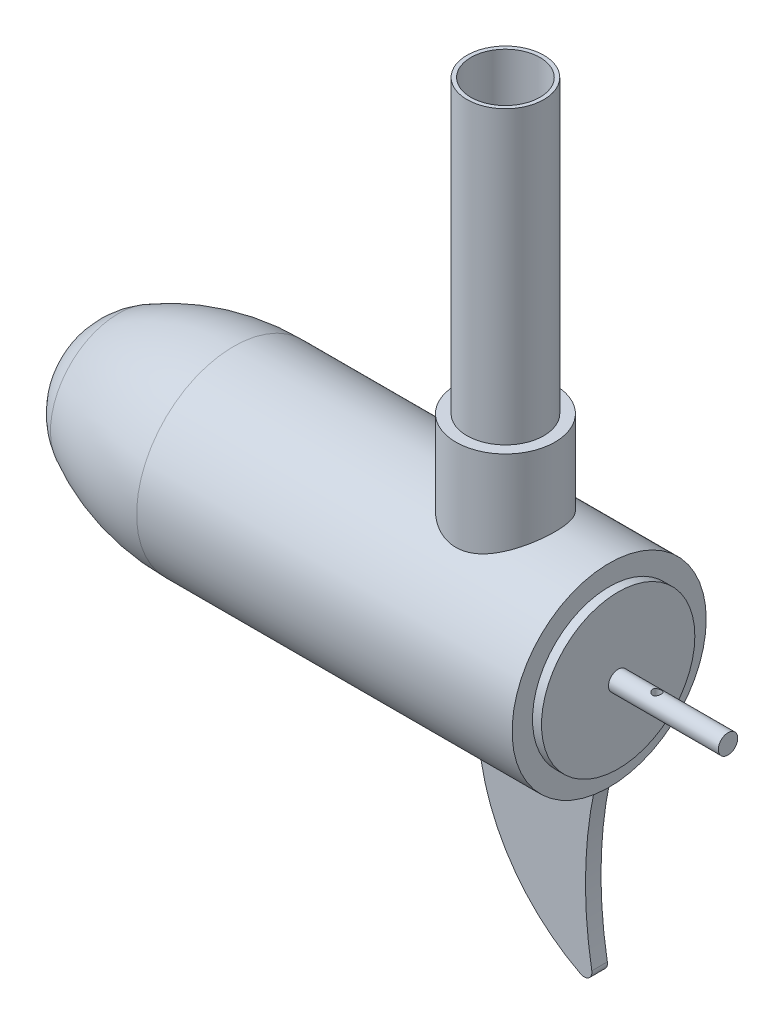
ISO-10303-21;
HEADER;
FILE_DESCRIPTION(('STEP AP214'),'2;1');
FILE_NAME('part.step','',(''),(''),'','','');
FILE_SCHEMA(('AUTOMOTIVE_DESIGN { 1 0 10303 214 1 1 1 1 }'));
ENDSEC;
DATA;
#1=APPLICATION_CONTEXT('core data for automotive mechanical design processes');
#2=APPLICATION_PROTOCOL_DEFINITION('international standard','automotive_design',2000,#1);
#3=PRODUCT_CONTEXT('',#1,'mechanical');
#4=PRODUCT('Part','Part','',(#3));
#5=PRODUCT_RELATED_PRODUCT_CATEGORY('part','',(#4));
#6=PRODUCT_DEFINITION_FORMATION('','',#4);
#7=PRODUCT_DEFINITION_CONTEXT('part definition',#1,'design');
#8=PRODUCT_DEFINITION('design','',#6,#7);
#9=PRODUCT_DEFINITION_SHAPE('','',#8);
#10=(LENGTH_UNIT() NAMED_UNIT(*) SI_UNIT(.MILLI.,.METRE.));
#11=(NAMED_UNIT(*) PLANE_ANGLE_UNIT() SI_UNIT($,.RADIAN.));
#12=(NAMED_UNIT(*) SI_UNIT($,.STERADIAN.) SOLID_ANGLE_UNIT());
#13=UNCERTAINTY_MEASURE_WITH_UNIT(LENGTH_MEASURE(1.E-05),#10,'distance_accuracy_value','');
#14=(GEOMETRIC_REPRESENTATION_CONTEXT(3) GLOBAL_UNCERTAINTY_ASSIGNED_CONTEXT((#13)) GLOBAL_UNIT_ASSIGNED_CONTEXT((#10,
#11,#12)) REPRESENTATION_CONTEXT('',''));
#15=CARTESIAN_POINT('',(0.,0.,0.));
#16=DIRECTION('',(0.,0.,1.));
#17=DIRECTION('',(1.,0.,0.));
#18=AXIS2_PLACEMENT_3D('',#15,#16,#17);
#19=CARTESIAN_POINT('',(0.,635.,0.));
#20=DIRECTION('',(0.,-1.,0.));
#21=DIRECTION('',(0.,0.,-1.));
#22=AXIS2_PLACEMENT_3D('',#19,#20,#21);
#23=CYLINDRICAL_SURFACE('',#22,12.573);
#24=CARTESIAN_POINT('',(0.,57.15,0.));
#25=DIRECTION('',(0.,1.,0.));
#26=DIRECTION('',(0.,0.,1.));
#27=AXIS2_PLACEMENT_3D('',#24,#25,#26);
#28=CIRCLE('',#27,12.573);
#29=CARTESIAN_POINT('',(0.,57.15,12.573));
#30=VERTEX_POINT('',#29);
#31=EDGE_CURVE('E115',#30,#30,#28,.T.);
#32=ORIENTED_EDGE('',*,*,#31,.T.);
#33=EDGE_LOOP('',(#32));
#34=FACE_BOUND('',#33,.T.);
#35=CARTESIAN_POINT('',(0.,152.4,0.));
#36=DIRECTION('',(0.,1.,0.));
#37=DIRECTION('',(0.,0.,1.));
#38=AXIS2_PLACEMENT_3D('',#35,#36,#37);
#39=CIRCLE('',#38,12.573);
#40=CARTESIAN_POINT('',(0.,152.4,12.573));
#41=VERTEX_POINT('',#40);
#42=EDGE_CURVE('E247',#41,#41,#39,.T.);
#43=ORIENTED_EDGE('',*,*,#42,.F.);
#44=EDGE_LOOP('',(#43));
#45=FACE_BOUND('',#44,.T.);
#46=ADVANCED_FACE('F36',(#34,#45),#23,.T.);
#47=CARTESIAN_POINT('',(0.,0.,0.));
#48=DIRECTION('',(1.,0.,0.));
#49=DIRECTION('',(0.,0.,-1.));
#50=AXIS2_PLACEMENT_3D('',#47,#48,#49);
#51=CYLINDRICAL_SURFACE('',#50,31.75);
#52=CARTESIAN_POINT('',(0.,27.3105372292454,-16.1925));
#53=CARTESIAN_POINT('',(-0.420748466015102,27.3105387069206,-16.1924989710694));
#54=CARTESIAN_POINT('',(-0.84151769713939,27.3202933337456,-16.1760793734818));
#55=CARTESIAN_POINT('',(-1.67978725725636,27.3589417899797,-16.1106244902705));
#56=CARTESIAN_POINT('',(-2.09728606689724,27.3878440365096,-16.0615748607399));
#57=CARTESIAN_POINT('',(-2.92632111293447,27.4637594355387,-15.9314180671734));
#58=CARTESIAN_POINT('',(-3.33784558043734,27.5108043289193,-15.8502547131046));
#59=CARTESIAN_POINT('',(-4.15122337999637,27.6212909415034,-15.6569202015565));
#60=CARTESIAN_POINT('',(-4.55307755733656,27.6847312218468,-15.544751765025));
#61=CARTESIAN_POINT('',(-5.3424663710121,27.8254800962585,-15.2913705658272));
#62=CARTESIAN_POINT('',(-5.73006792150555,27.9027100346481,-15.1503218980556));
#63=CARTESIAN_POINT('',(-6.49123738513855,28.0689084733055,-14.8401419463507));
#64=CARTESIAN_POINT('',(-6.86480503600685,28.1578771928123,-14.6710101379081));
#65=CARTESIAN_POINT('',(-7.59612644232784,28.3450458663397,-14.3060443325047));
#66=CARTESIAN_POINT('',(-7.95388335488376,28.4432439650725,-14.1102156985839));
#67=CARTESIAN_POINT('',(-8.65234384595785,28.6464097106673,-13.6930474766081));
#68=CARTESIAN_POINT('',(-8.99304108812239,28.7513798401731,-13.4716985090568));
#69=CARTESIAN_POINT('',(-9.6844468708347,28.9747806383787,-12.9846973009489));
#70=CARTESIAN_POINT('',(-10.0335036881233,29.0935932243362,-12.7168729923331));
#71=CARTESIAN_POINT('',(-10.7083163650837,29.3331547094797,-12.1540965481257));
#72=CARTESIAN_POINT('',(-11.0340709743125,29.4539037121527,-11.8591429586611));
#73=CARTESIAN_POINT('',(-11.6609534581884,29.6944344654934,-11.2433264131629));
#74=CARTESIAN_POINT('',(-11.9620647596046,29.8142155171817,-10.9224463044879));
#75=CARTESIAN_POINT('',(-12.5377223547456,30.0498082670856,-10.2565210067565));
#76=CARTESIAN_POINT('',(-12.8122774992704,30.1656212794259,-9.91148393543222));
#77=CARTESIAN_POINT('',(-13.3518173606166,30.3985707195755,-9.17330970553672));
#78=CARTESIAN_POINT('',(-13.6147292882266,30.5152144127099,-8.77849695562083));
#79=CARTESIAN_POINT('',(-14.1060859296451,30.7375844730744,-7.96499815906814));
#80=CARTESIAN_POINT('',(-14.3345285661519,30.8433101822081,-7.54631067570729));
#81=CARTESIAN_POINT('',(-14.7545606871617,31.040749870666,-6.68791257607114));
#82=CARTESIAN_POINT('',(-14.9461687204122,31.1324708974947,-6.24821268100757));
#83=CARTESIAN_POINT('',(-15.2904317013661,31.2992019943351,-5.35076227152712));
#84=CARTESIAN_POINT('',(-15.4430909828293,31.374213923421,-4.89301377189654));
#85=CARTESIAN_POINT('',(-15.6977262022939,31.5003611897658,-3.99737367876167));
#86=CARTESIAN_POINT('',(-15.8026030690177,31.5528464083167,-3.56049615747574));
#87=CARTESIAN_POINT('',(-15.9758775656995,31.6399823498011,-2.67780437655771));
#88=CARTESIAN_POINT('',(-16.0442768344999,31.6746338739531,-2.23199051934551));
#89=CARTESIAN_POINT('',(-16.1436407309051,31.7250807335097,-1.33538777339915));
#90=CARTESIAN_POINT('',(-16.1746253070345,31.7408861171217,-0.884601665238475));
#91=CARTESIAN_POINT('',(-16.1987840371121,31.7532034311602,0.0182342829470127));
#92=CARTESIAN_POINT('',(-16.1919606286812,31.7497166054271,0.470284039621484));
#93=CARTESIAN_POINT('',(-16.1429411815475,31.7247478570976,1.33082900945518));
#94=CARTESIAN_POINT('',(-16.1040027594924,31.7049233073107,1.73956297698246));
#95=CARTESIAN_POINT('',(-15.9954051492326,31.6499010006413,2.55185134842287));
#96=CARTESIAN_POINT('',(-15.9257482141708,31.6147043712728,2.95540612998548));
#97=CARTESIAN_POINT('',(-15.7564827199828,31.5297770344751,3.75462129565882));
#98=CARTESIAN_POINT('',(-15.6568731777315,31.4800458499842,4.15028142019104));
#99=CARTESIAN_POINT('',(-15.4287297961663,31.3672014027916,4.93121144994875));
#100=CARTESIAN_POINT('',(-15.3001948993253,31.3040876508206,5.31648097471123));
#101=CARTESIAN_POINT('',(-15.0135188568846,31.1649688015372,6.07943989650621));
#102=CARTESIAN_POINT('',(-14.8550070053428,31.0888035508072,6.45696054572714));
#103=CARTESIAN_POINT('',(-14.5108989011623,30.925857656925,7.19704235782948));
#104=CARTESIAN_POINT('',(-14.3253026980021,30.8390770331652,7.55960354803776));
#105=CARTESIAN_POINT('',(-13.9283827222025,30.6567156266017,8.26814061210105));
#106=CARTESIAN_POINT('',(-13.7170529644526,30.5611327978458,8.61411260146137));
#107=CARTESIAN_POINT('',(-13.2700731560107,30.363137827612,9.28793333646348));
#108=CARTESIAN_POINT('',(-13.0344208252362,30.2607250461895,9.61578037857775));
#109=CARTESIAN_POINT('',(-12.5160714758153,30.0409246449944,10.283016158325));
#110=CARTESIAN_POINT('',(-12.2310279904816,29.9230495763589,10.6204237486858));
#111=CARTESIAN_POINT('',(-11.6349275840735,29.6843795787961,11.270313779243));
#112=CARTESIAN_POINT('',(-11.3238691527413,29.5635844806408,11.5827947703034));
#113=CARTESIAN_POINT('',(-10.6771379793242,29.3219493100036,12.1815463782784));
#114=CARTESIAN_POINT('',(-10.3414516860976,29.2011092497176,12.4678023674889));
#115=CARTESIAN_POINT('',(-9.64699772044029,28.962452235663,13.0125845089775));
#116=CARTESIAN_POINT('',(-9.28821914849836,28.844636746733,13.2710974107322));
#117=CARTESIAN_POINT('',(-8.52404517770724,28.6074125207556,13.7753880286337));
#118=CARTESIAN_POINT('',(-8.11713944482276,28.4884441514149,14.0190913551747));
#119=CARTESIAN_POINT('',(-7.28129326799219,28.2616528081136,14.470845378222));
#120=CARTESIAN_POINT('',(-6.85236460258649,28.1538239674553,14.678914879863));
#121=CARTESIAN_POINT('',(-5.97504738907723,27.9532546703778,15.0573546693885));
#122=CARTESIAN_POINT('',(-5.52667019090442,27.8605055597766,15.2277466006037));
#123=CARTESIAN_POINT('',(-4.61338684269047,27.6938149889371,15.5288375462474));
#124=CARTESIAN_POINT('',(-4.1484830497966,27.6198708587606,15.6595421960025));
#125=CARTESIAN_POINT('',(-3.24374665951823,27.4991407403212,15.8705174756291));
#126=CARTESIAN_POINT('',(-2.80488716337229,27.4506542835127,15.9539883583188));
#127=CARTESIAN_POINT('',(-1.91998908200027,27.3743968387433,16.0844849116838));
#128=CARTESIAN_POINT('',(-1.47395091455951,27.3466246496721,16.1315126955068));
#129=CARTESIAN_POINT('',(-0.57897809044468,27.3130157846587,16.1883528298615));
#130=CARTESIAN_POINT('',(-0.130045551038082,27.3071645724646,16.1981898424005));
#131=CARTESIAN_POINT('',(0.766807064801971,27.3176213800444,16.1805494749401));
#132=CARTESIAN_POINT('',(1.21472721395478,27.3339277540833,16.1530748662284));
#133=CARTESIAN_POINT('',(2.05361525851629,27.3848186779578,16.0666217495261));
#134=CARTESIAN_POINT('',(2.44515098536332,27.4170581895218,16.0116765800726));
#135=CARTESIAN_POINT('',(3.22156839319666,27.497179340615,15.8736886599332));
#136=CARTESIAN_POINT('',(3.60645069651641,27.5450595087556,15.7906485522412));
#137=CARTESIAN_POINT('',(4.36733627833684,27.6549681514112,15.5973578563071));
#138=CARTESIAN_POINT('',(4.743337214906,27.7170003127088,15.4871001769103));
#139=CARTESIAN_POINT('',(5.48436670329088,27.8533848077631,15.2404493115307));
#140=CARTESIAN_POINT('',(5.84939456583778,27.9277379135521,15.1040544877067));
#141=CARTESIAN_POINT('',(6.58318079671202,28.0903881460422,14.799450507088));
#142=CARTESIAN_POINT('',(6.95134601777157,28.1791675358805,14.6300714631583));
#143=CARTESIAN_POINT('',(7.67229271056367,28.3656163493504,14.2652121550295));
#144=CARTESIAN_POINT('',(8.02506897498789,28.4632887482051,14.069723145256));
#145=CARTESIAN_POINT('',(8.71381814417392,28.6650940140789,13.6538747999114));
#146=CARTESIAN_POINT('',(9.04978686956206,28.7692284736774,13.4335093224676));
#147=CARTESIAN_POINT('',(9.70360700370493,28.9815425754529,12.9691125783415));
#148=CARTESIAN_POINT('',(10.0214572045398,29.0897224865362,12.7250797367342));
#149=CARTESIAN_POINT('',(10.678730865835,29.3222463054979,12.180607304189));
#150=CARTESIAN_POINT('',(11.0154330119251,29.4468328064333,11.8769780564265));
#151=CARTESIAN_POINT('',(11.6623201282583,29.6948805817402,11.2424453256809));
#152=CARTESIAN_POINT('',(11.9725120584968,29.8183421438018,10.9115490464759));
#153=CARTESIAN_POINT('',(12.5649173333546,30.0610968660521,10.2237953766132));
#154=CARTESIAN_POINT('',(12.8471147863585,30.1803876340094,9.86692343738312));
#155=CARTESIAN_POINT('',(13.3814677820726,30.4116936848314,9.12912039945865));
#156=CARTESIAN_POINT('',(13.6336235434791,30.5237090206567,8.74818947593866));
#157=CARTESIAN_POINT('',(14.1131951757634,30.7408621552026,7.95218391988009));
#158=CARTESIAN_POINT('',(14.3396133998741,30.8456830767824,7.5364199713589));
#159=CARTESIAN_POINT('',(14.7562420682957,31.041557776433,6.68396749079989));
#160=CARTESIAN_POINT('',(14.9464511674889,31.1326110430291,6.24727818216862));
#161=CARTESIAN_POINT('',(15.2883473685012,31.2981891882218,5.35639290256029));
#162=CARTESIAN_POINT('',(15.4400630161999,31.3727263095943,4.90221019389549));
#163=CARTESIAN_POINT('',(15.7031546933985,31.5030383721622,3.97969363986757));
#164=CARTESIAN_POINT('',(15.8145357434036,31.5588156483609,3.51136156356419));
#165=CARTESIAN_POINT('',(15.9868503764071,31.6455344662884,2.60926839584908));
#166=CARTESIAN_POINT('',(16.051543830027,31.6783186778626,2.17639939024798));
#167=CARTESIAN_POINT('',(16.145691733958,31.7261271675578,1.30587673935893));
#168=CARTESIAN_POINT('',(16.1751484674551,31.7411525963697,0.868223405929174));
#169=CARTESIAN_POINT('',(16.1984282269959,31.7530222781351,-0.00813211946787927));
#170=CARTESIAN_POINT('',(16.1922627256626,31.7498723846975,-0.44683392826443));
#171=CARTESIAN_POINT('',(16.1444072969559,31.72549294038,-1.32178045860439));
#172=CARTESIAN_POINT('',(16.1027184819466,31.7042639556222,-1.75802525665517));
#173=CARTESIAN_POINT('',(15.9885463305423,31.6464348177011,-2.59397302273972));
#174=CARTESIAN_POINT('',(15.9184381285208,31.6110223013007,-2.99408604041674));
#175=CARTESIAN_POINT('',(15.7487794704582,31.5259276207634,-3.78644156000793));
#176=CARTESIAN_POINT('',(15.6492307809595,31.4762463128141,-4.17868453264753));
#177=CARTESIAN_POINT('',(15.4216912674134,31.3637407332485,-4.95291051346713));
#178=CARTESIAN_POINT('',(15.2936983699637,31.3009155035434,-5.33489277142983));
#179=CARTESIAN_POINT('',(15.010454358319,31.1635019481535,-6.08642731089245));
#180=CARTESIAN_POINT('',(14.8552019616212,31.0889130690304,-6.4559790065851));
#181=CARTESIAN_POINT('',(14.5117419954506,30.926239389282,-7.19580118419143));
#182=CARTESIAN_POINT('',(14.3224347679716,30.8377231863766,-7.56546592766107));
#183=CARTESIAN_POINT('',(13.9171373353812,30.6515865152353,-8.28744523781354));
#184=CARTESIAN_POINT('',(13.7011466631932,30.5539658876396,-8.63975950063625));
#185=CARTESIAN_POINT('',(13.243903696533,30.3516784652166,-9.32555391497286));
#186=CARTESIAN_POINT('',(13.0026463073981,30.2470102508717,-9.65903024714672));
#187=CARTESIAN_POINT('',(12.4962323522163,30.0327922363139,-10.3058241760049));
#188=CARTESIAN_POINT('',(12.231067224048,29.9232406943848,-10.6191344811946));
#189=CARTESIAN_POINT('',(11.6497931038198,29.6901519722321,-11.2553828674752));
#190=CARTESIAN_POINT('',(11.3312494096049,29.5663350405272,-11.5759980734691));
#191=CARTESIAN_POINT('',(10.6684742097343,29.3187192120812,-12.1895312847721));
#192=CARTESIAN_POINT('',(10.3242404387511,29.1949203178972,-12.482446842376));
#193=CARTESIAN_POINT('',(9.61134238625906,28.9504942689177,-13.0393235245791));
#194=CARTESIAN_POINT('',(9.2426506728145,28.8298708949603,-13.303251224722));
#195=CARTESIAN_POINT('',(8.48305463416344,28.5954058008814,-13.8000252636623));
#196=CARTESIAN_POINT('',(8.09215926104119,28.4815613850075,-14.0328840038151));
#197=CARTESIAN_POINT('',(7.27455098545164,28.2599344133068,-14.4741807776841));
#198=CARTESIAN_POINT('',(6.84704012987372,28.1525498787747,-14.6813451944233));
#199=CARTESIAN_POINT('',(5.97237799936851,27.9527017132259,-15.0583714118292));
#200=CARTESIAN_POINT('',(5.5252234520158,27.8602405803688,-15.2282269687511));
#201=CARTESIAN_POINT('',(4.61577332949905,27.6942514851407,-15.5280473720993));
#202=CARTESIAN_POINT('',(4.15352582612627,27.6206689771949,-15.6581273549354));
#203=CARTESIAN_POINT('',(3.21670905556563,27.495409775022,-15.8770571708136));
#204=CARTESIAN_POINT('',(2.74214851548876,27.4437179923737,-15.9659354066223));
#205=CARTESIAN_POINT('',(1.88965416873099,27.3732923852994,-16.0862988306376));
#206=CARTESIAN_POINT('',(1.51325916106804,27.3498255830207,-16.1260803404131));
#207=CARTESIAN_POINT('',(0.757915162888449,27.3184468226147,-16.1791822678137));
#208=CARTESIAN_POINT('',(0.378966004305467,27.3105358983109,-16.1925009267525));
#209=CARTESIAN_POINT('',(0.,27.3105372292454,-16.1925));
#210=B_SPLINE_CURVE_WITH_KNOTS('',3,(#52,#53,#54,#55,#56,#57,#58,#59,#60,#61,#62,#63,#64,#65,
#66,#67,#68,#69,#70,#71,#72,#73,#74,#75,#76,#77,#78,#79,#80,#81,#82,#83,#84,#85,#86,#87,#88,#89,
#90,#91,#92,#93,#94,#95,#96,#97,#98,#99,#100,#101,#102,#103,#104,#105,#106,#107,#108,#109,#110,
#111,#112,#113,#114,#115,#116,#117,#118,#119,#120,#121,#122,#123,#124,#125,#126,#127,#128,#129,
#130,#131,#132,#133,#134,#135,#136,#137,#138,#139,#140,#141,#142,#143,#144,#145,#146,#147,#148,
#149,#150,#151,#152,#153,#154,#155,#156,#157,#158,#159,#160,#161,#162,#163,#164,#165,#166,#167,
#168,#169,#170,#171,#172,#173,#174,#175,#176,#177,#178,#179,#180,#181,#182,#183,#184,#185,#186,
#187,#188,#189,#190,#191,#192,#193,#194,#195,#196,#197,#198,#199,#200,#201,#202,#203,#204,#205,
#206,#207,#208,#209),.UNSPECIFIED.,.T.,.F.,(4,2,2,2,2,2,2,2,2,2,2,2,2,2,2,2,2,2,2,2,2,2,2,2,2,2,
2,2,2,2,2,2,2,2,2,2,2,2,2,2,2,2,2,2,2,2,2,2,2,2,2,2,2,2,2,2,2,2,2,2,2,2,2,2,2,2,2,2,2,2,2,2,2,2,
2,2,2,2,4),(0.,1.26185282222737,2.52426071195958,3.78888730021835,5.05340294243742,
6.31092374385873,7.56846803466289,8.82576007265459,10.0835156855463,11.4492542544087,
12.8150660566337,14.1817889792728,15.5480548110517,17.0115856849487,18.4752047237501,
19.9380847882306,21.400802009533,22.7559884559795,24.1111140123386,25.4655167321204,
26.8198321295514,28.0515631829677,29.2832039063386,30.5148850598844,31.7466112517002,
32.9947043218849,34.2427951120409,35.4911767395999,36.7396755012693,38.1096611054973,
39.4797262974287,40.8505510859349,42.2220277145174,43.6871374334733,45.1514715674839,
46.6149623382286,48.0782452058579,49.4243642474171,50.7704052286263,52.1155534641475,
53.4606017954383,54.6492983157918,55.8378830421806,57.0267777650082,58.2157470123443,
59.4591032577414,60.7028770166303,61.946958531314,63.1911228892444,64.600129367535,
66.0087647813706,67.4181953131138,68.8276155839243,70.2803217998534,71.733081971232,
73.1847616385255,74.6362605510111,75.9512215536864,77.2660973479999,78.5805496923808,
79.8949608779975,81.1168165934344,82.3385990077007,83.5604705113818,84.7823995169848,
86.0550021614255,87.3276270851192,88.6005091108167,89.8738488206274,91.2781249686781,
92.6825250911628,94.0885279237172,95.493967852345,96.9531271865162,98.4125305294518,
99.8676685205345,101.32180190299,102.458270799158,103.594815221031),.UNSPECIFIED.);
#211=CARTESIAN_POINT('',(0.,27.3105372292454,-16.1925));
#212=VERTEX_POINT('',#211);
#213=EDGE_CURVE('E11',#212,#212,#210,.T.);
#214=ORIENTED_EDGE('',*,*,#213,.F.);
#215=EDGE_LOOP('',(#214));
#216=FACE_BOUND('',#215,.T.);
#217=CARTESIAN_POINT('',(-88.9,0.,0.));
#218=DIRECTION('',(1.,0.,0.));
#219=DIRECTION('',(0.,0.,-1.));
#220=AXIS2_PLACEMENT_3D('',#217,#218,#219);
#221=CIRCLE('',#220,31.75);
#222=CARTESIAN_POINT('',(-88.9,0.,-31.75));
#223=VERTEX_POINT('',#222);
#224=EDGE_CURVE('E143',#223,#223,#221,.T.);
#225=ORIENTED_EDGE('',*,*,#224,.T.);
#226=EDGE_LOOP('',(#225));
#227=FACE_BOUND('',#226,.T.);
#228=DIRECTION('',(1.,0.,0.));
#229=VECTOR('',#228,1.);
#230=CARTESIAN_POINT('',(0.,-31.6482369177179,-2.54));
#231=LINE('',#230,#229);
#232=CARTESIAN_POINT('',(-6.35,-31.6482369177179,-2.54));
#233=VERTEX_POINT('',#232);
#234=CARTESIAN_POINT('',(31.75,-31.6482369177179,-2.54));
#235=VERTEX_POINT('',#234);
#236=EDGE_CURVE('E153',#233,#235,#231,.T.);
#237=ORIENTED_EDGE('',*,*,#236,.F.);
#238=CARTESIAN_POINT('',(-6.35,0.,0.));
#239=DIRECTION('',(1.,0.,0.));
#240=DIRECTION('',(0.,0.,-1.));
#241=AXIS2_PLACEMENT_3D('',#238,#239,#240);
#242=CIRCLE('',#241,31.75);
#243=CARTESIAN_POINT('',(-6.35,-31.75,0.));
#244=VERTEX_POINT('',#243);
#245=EDGE_CURVE('E152',#244,#233,#242,.T.);
#246=ORIENTED_EDGE('',*,*,#245,.F.);
#247=CARTESIAN_POINT('',(-6.35,-31.6482369177179,2.54));
#248=VERTEX_POINT('',#247);
#249=EDGE_CURVE('E149',#248,#244,#242,.T.);
#250=ORIENTED_EDGE('',*,*,#249,.F.);
#251=DIRECTION('',(1.,0.,0.));
#252=VECTOR('',#251,1.);
#253=CARTESIAN_POINT('',(0.,-31.6482369177179,2.54));
#254=LINE('',#253,#252);
#255=CARTESIAN_POINT('',(31.75,-31.6482369177179,2.54));
#256=VERTEX_POINT('',#255);
#257=EDGE_CURVE('E146',#248,#256,#254,.T.);
#258=ORIENTED_EDGE('',*,*,#257,.T.);
#259=CARTESIAN_POINT('',(31.75,0.,0.));
#260=DIRECTION('',(1.,0.,0.));
#261=DIRECTION('',(0.,0.,-1.));
#262=AXIS2_PLACEMENT_3D('',#259,#260,#261);
#263=CIRCLE('',#262,31.75);
#264=CARTESIAN_POINT('',(31.75,-31.75,0.));
#265=VERTEX_POINT('',#264);
#266=EDGE_CURVE('E110',#256,#265,#263,.T.);
#267=ORIENTED_EDGE('',*,*,#266,.T.);
#268=EDGE_CURVE('E150',#265,#235,#263,.T.);
#269=ORIENTED_EDGE('',*,*,#268,.T.);
#270=EDGE_LOOP('',(#237,#246,#250,#258,#267,#269));
#271=FACE_BOUND('',#270,.T.);
#272=CARTESIAN_POINT('',(33.94202,0.,0.));
#273=DIRECTION('',(1.,0.,0.));
#274=DIRECTION('',(0.,0.,-1.));
#275=AXIS2_PLACEMENT_3D('',#272,#273,#274);
#276=CIRCLE('',#275,31.75);
#277=CARTESIAN_POINT('',(33.94202,0.,-31.75));
#278=VERTEX_POINT('',#277);
#279=EDGE_CURVE('E167',#278,#278,#276,.T.);
#280=ORIENTED_EDGE('',*,*,#279,.F.);
#281=EDGE_LOOP('',(#280));
#282=FACE_BOUND('',#281,.T.);
#283=ADVANCED_FACE('F169',(#216,#227,#271,#282),#51,.T.);
#284=CARTESIAN_POINT('',(-88.9,0.,0.));
#285=DIRECTION('',(1.,0.,0.));
#286=DIRECTION('',(0.,0.,-1.));
#287=AXIS2_PLACEMENT_3D('',#284,#285,#286);
#288=DEGENERATE_TOROIDAL_SURFACE('',#287,47.607925664556,79.357925664556,.F.);
#289=CARTESIAN_POINT('',(-126.59672212421,0.,0.));
#290=DIRECTION('',(1.,0.,0.));
#291=DIRECTION('',(0.,0.,-1.));
#292=AXIS2_PLACEMENT_3D('',#289,#290,#291);
#293=CIRCLE('',#292,22.2249999999994);
#294=CARTESIAN_POINT('',(-126.59672212421,0.,-22.2249999999994));
#295=VERTEX_POINT('',#294);
#296=EDGE_CURVE('E138',#295,#295,#293,.T.);
#297=ORIENTED_EDGE('',*,*,#296,.T.);
#298=EDGE_LOOP('',(#297));
#299=FACE_BOUND('',#298,.T.);
#300=ORIENTED_EDGE('',*,*,#224,.F.);
#301=EDGE_LOOP('',(#300));
#302=FACE_BOUND('',#301,.T.);
#303=ADVANCED_FACE('F210',(#299,#302),#288,.F.);
#304=CARTESIAN_POINT('',(-114.3,0.,0.));
#305=DIRECTION('',(1.,0.,0.));
#306=DIRECTION('',(0.,1.,0.));
#307=AXIS2_PLACEMENT_3D('',#304,#305,#306);
#308=SPHERICAL_SURFACE('',#307,25.4);
#309=ORIENTED_EDGE('',*,*,#296,.F.);
#310=EDGE_LOOP('',(#309));
#311=FACE_BOUND('',#310,.T.);
#312=ADVANCED_FACE('F196',(#311),#308,.T.);
#313=CARTESIAN_POINT('',(-6.35,0.,-2.54));
#314=DIRECTION('',(1.,0.,0.));
#315=DIRECTION('',(0.,0.,-1.));
#316=AXIS2_PLACEMENT_3D('',#313,#314,#315);
#317=PLANE('',#316);
#318=DIRECTION('',(0.,1.,0.));
#319=VECTOR('',#318,1.);
#320=CARTESIAN_POINT('',(-6.35,0.,2.54));
#321=LINE('',#320,#319);
#322=CARTESIAN_POINT('',(-6.35,-31.75,2.54));
#323=VERTEX_POINT('',#322);
#324=EDGE_CURVE('E112',#323,#248,#321,.T.);
#325=ORIENTED_EDGE('',*,*,#324,.T.);
#326=ORIENTED_EDGE('',*,*,#249,.T.);
#327=DIRECTION('',(0.,0.,1.));
#328=VECTOR('',#327,1.);
#329=CARTESIAN_POINT('',(-6.35,-31.75,-2.54));
#330=LINE('',#329,#328);
#331=EDGE_CURVE('E139',#244,#323,#330,.T.);
#332=ORIENTED_EDGE('',*,*,#331,.T.);
#333=EDGE_LOOP('',(#325,#326,#332));
#334=FACE_BOUND('',#333,.T.);
#335=ADVANCED_FACE('F192',(#334),#317,.F.);
#336=CARTESIAN_POINT('',(-6.35,-31.75,-2.54));
#337=VERTEX_POINT('',#336);
#338=EDGE_CURVE('E136',#337,#244,#330,.T.);
#339=ORIENTED_EDGE('',*,*,#338,.T.);
#340=ORIENTED_EDGE('',*,*,#245,.T.);
#341=DIRECTION('',(0.,1.,0.));
#342=VECTOR('',#341,1.);
#343=CARTESIAN_POINT('',(-6.35,0.,-2.54));
#344=LINE('',#343,#342);
#345=EDGE_CURVE('E131',#337,#233,#344,.T.);
#346=ORIENTED_EDGE('',*,*,#345,.F.);
#347=EDGE_LOOP('',(#339,#340,#346));
#348=FACE_BOUND('',#347,.T.);
#349=ADVANCED_FACE('F195',(#348),#317,.F.);
#350=CARTESIAN_POINT('',(31.75,0.,-2.54));
#351=DIRECTION('',(1.,0.,0.));
#352=DIRECTION('',(0.,0.,-1.));
#353=AXIS2_PLACEMENT_3D('',#350,#351,#352);
#354=PLANE('',#353);
#355=ORIENTED_EDGE('',*,*,#266,.F.);
#356=DIRECTION('',(0.,1.,0.));
#357=VECTOR('',#356,1.);
#358=CARTESIAN_POINT('',(31.75,0.,2.54));
#359=LINE('',#358,#357);
#360=CARTESIAN_POINT('',(31.75,-31.75,2.54));
#361=VERTEX_POINT('',#360);
#362=EDGE_CURVE('E108',#361,#256,#359,.T.);
#363=ORIENTED_EDGE('',*,*,#362,.F.);
#364=DIRECTION('',(0.,0.,1.));
#365=VECTOR('',#364,1.);
#366=CARTESIAN_POINT('',(31.75,-31.75,-2.54));
#367=LINE('',#366,#365);
#368=EDGE_CURVE('E98',#265,#361,#367,.T.);
#369=ORIENTED_EDGE('',*,*,#368,.F.);
#370=EDGE_LOOP('',(#355,#363,#369));
#371=FACE_BOUND('',#370,.T.);
#372=ADVANCED_FACE('F109',(#371),#354,.T.);
#373=ORIENTED_EDGE('',*,*,#268,.F.);
#374=CARTESIAN_POINT('',(31.75,-31.75,-2.54));
#375=VERTEX_POINT('',#374);
#376=EDGE_CURVE('E102',#375,#265,#367,.T.);
#377=ORIENTED_EDGE('',*,*,#376,.F.);
#378=DIRECTION('',(0.,1.,0.));
#379=VECTOR('',#378,1.);
#380=CARTESIAN_POINT('',(31.75,0.,-2.54));
#381=LINE('',#380,#379);
#382=EDGE_CURVE('E128',#375,#235,#381,.T.);
#383=ORIENTED_EDGE('',*,*,#382,.T.);
#384=EDGE_LOOP('',(#373,#377,#383));
#385=FACE_BOUND('',#384,.T.);
#386=ADVANCED_FACE('F186',(#385),#354,.T.);
#387=CARTESIAN_POINT('',(0.,0.,-2.54));
#388=DIRECTION('',(0.,0.,1.));
#389=DIRECTION('',(1.,0.,0.));
#390=AXIS2_PLACEMENT_3D('',#387,#388,#389);
#391=PLANE('',#390);
#392=CARTESIAN_POINT('',(165.251104864342,-60.325,-2.54));
#393=DIRECTION('',(0.,0.,1.));
#394=DIRECTION('',(1.,0.,0.));
#395=AXIS2_PLACEMENT_3D('',#392,#393,#394);
#396=CIRCLE('',#395,136.525);
#397=CARTESIAN_POINT('',(30.8038942959617,-84.0531098147671,-2.54));
#398=VERTEX_POINT('',#397);
#399=EDGE_CURVE('E126',#375,#398,#396,.T.);
#400=ORIENTED_EDGE('',*,*,#399,.T.);
#401=CARTESIAN_POINT('',(28.3025508435267,-84.4945630206232,-2.54));
#402=DIRECTION('',(0.,0.,1.));
#403=DIRECTION('',(1.,0.,0.));
#404=AXIS2_PLACEMENT_3D('',#401,#402,#403);
#405=CIRCLE('',#404,2.54);
#406=CARTESIAN_POINT('',(27.1363498100947,-86.7510149145536,-2.54));
#407=VERTEX_POINT('',#406);
#408=EDGE_CURVE('E160',#398,#407,#405,.F.);
#409=ORIENTED_EDGE('',*,*,#408,.T.);
#410=CARTESIAN_POINT('',(55.5625,-31.75,-2.54));
#411=DIRECTION('',(0.,0.,1.));
#412=DIRECTION('',(1.,0.,0.));
#413=AXIS2_PLACEMENT_3D('',#410,#411,#412);
#414=CIRCLE('',#413,61.9125);
#415=EDGE_CURVE('E106',#337,#407,#414,.T.);
#416=ORIENTED_EDGE('',*,*,#415,.F.);
#417=ORIENTED_EDGE('',*,*,#345,.T.);
#418=ORIENTED_EDGE('',*,*,#236,.T.);
#419=ORIENTED_EDGE('',*,*,#382,.F.);
#420=EDGE_LOOP('',(#400,#409,#416,#417,#418,#419));
#421=FACE_BOUND('',#420,.T.);
#422=ADVANCED_FACE('F183',(#421),#391,.F.);
#423=CARTESIAN_POINT('',(0.,0.,2.54));
#424=DIRECTION('',(0.,0.,1.));
#425=DIRECTION('',(1.,0.,0.));
#426=AXIS2_PLACEMENT_3D('',#423,#424,#425);
#427=PLANE('',#426);
#428=CARTESIAN_POINT('',(55.5625,-31.75,2.54));
#429=DIRECTION('',(0.,0.,1.));
#430=DIRECTION('',(1.,0.,0.));
#431=AXIS2_PLACEMENT_3D('',#428,#429,#430);
#432=CIRCLE('',#431,61.9125);
#433=CARTESIAN_POINT('',(27.1363498100947,-86.7510149145536,2.54));
#434=VERTEX_POINT('',#433);
#435=EDGE_CURVE('E124',#323,#434,#432,.T.);
#436=ORIENTED_EDGE('',*,*,#435,.T.);
#437=CARTESIAN_POINT('',(28.3025508435267,-84.4945630206232,2.54));
#438=DIRECTION('',(0.,0.,1.));
#439=DIRECTION('',(1.,0.,0.));
#440=AXIS2_PLACEMENT_3D('',#437,#438,#439);
#441=CIRCLE('',#440,2.54);
#442=CARTESIAN_POINT('',(30.8038942959617,-84.0531098147671,2.54));
#443=VERTEX_POINT('',#442);
#444=EDGE_CURVE('E61',#434,#443,#441,.T.);
#445=ORIENTED_EDGE('',*,*,#444,.T.);
#446=CARTESIAN_POINT('',(165.251104864342,-60.325,2.54));
#447=DIRECTION('',(0.,0.,1.));
#448=DIRECTION('',(1.,0.,0.));
#449=AXIS2_PLACEMENT_3D('',#446,#447,#448);
#450=CIRCLE('',#449,136.525);
#451=EDGE_CURVE('E101',#361,#443,#450,.T.);
#452=ORIENTED_EDGE('',*,*,#451,.F.);
#453=ORIENTED_EDGE('',*,*,#362,.T.);
#454=ORIENTED_EDGE('',*,*,#257,.F.);
#455=ORIENTED_EDGE('',*,*,#324,.F.);
#456=EDGE_LOOP('',(#436,#445,#452,#453,#454,#455));
#457=FACE_BOUND('',#456,.T.);
#458=ADVANCED_FACE('F114',(#457),#427,.T.);
#459=CARTESIAN_POINT('',(165.251104864342,-60.325,-2.54));
#460=DIRECTION('',(0.,0.,1.));
#461=DIRECTION('',(1.,0.,0.));
#462=AXIS2_PLACEMENT_3D('',#459,#460,#461);
#463=CYLINDRICAL_SURFACE('',#462,136.525);
#464=ORIENTED_EDGE('',*,*,#451,.T.);
#465=DIRECTION('',(0.,0.,1.));
#466=VECTOR('',#465,1.);
#467=CARTESIAN_POINT('',(30.8038942959617,-84.0531098147671,-2.54));
#468=LINE('',#467,#466);
#469=EDGE_CURVE('E53',#443,#398,#468,.F.);
#470=ORIENTED_EDGE('',*,*,#469,.T.);
#471=ORIENTED_EDGE('',*,*,#399,.F.);
#472=ORIENTED_EDGE('',*,*,#376,.T.);
#473=ORIENTED_EDGE('',*,*,#368,.T.);
#474=EDGE_LOOP('',(#464,#470,#471,#472,#473));
#475=FACE_BOUND('',#474,.T.);
#476=ADVANCED_FACE('F100',(#475),#463,.F.);
#477=CARTESIAN_POINT('',(55.5625,-31.75,-2.54));
#478=DIRECTION('',(0.,0.,1.));
#479=DIRECTION('',(1.,0.,0.));
#480=AXIS2_PLACEMENT_3D('',#477,#478,#479);
#481=CYLINDRICAL_SURFACE('',#480,61.9125);
#482=ORIENTED_EDGE('',*,*,#415,.T.);
#483=DIRECTION('',(0.,0.,1.));
#484=VECTOR('',#483,1.);
#485=CARTESIAN_POINT('',(27.1363498100947,-86.7510149145536,-2.54));
#486=LINE('',#485,#484);
#487=EDGE_CURVE('E155',#407,#434,#486,.T.);
#488=ORIENTED_EDGE('',*,*,#487,.T.);
#489=ORIENTED_EDGE('',*,*,#435,.F.);
#490=ORIENTED_EDGE('',*,*,#331,.F.);
#491=ORIENTED_EDGE('',*,*,#338,.F.);
#492=EDGE_LOOP('',(#482,#488,#489,#490,#491));
#493=FACE_BOUND('',#492,.T.);
#494=ADVANCED_FACE('F188',(#493),#481,.T.);
#495=CARTESIAN_POINT('',(28.3025508435267,-84.4945630206232,-2.54));
#496=DIRECTION('',(0.,0.,-1.));
#497=DIRECTION('',(-1.,0.,0.));
#498=AXIS2_PLACEMENT_3D('',#495,#496,#497);
#499=CYLINDRICAL_SURFACE('',#498,2.54);
#500=ORIENTED_EDGE('',*,*,#408,.F.);
#501=ORIENTED_EDGE('',*,*,#469,.F.);
#502=ORIENTED_EDGE('',*,*,#444,.F.);
#503=ORIENTED_EDGE('',*,*,#487,.F.);
#504=EDGE_LOOP('',(#500,#501,#502,#503));
#505=FACE_BOUND('',#504,.T.);
#506=ADVANCED_FACE('F38',(#505),#499,.T.);
#507=CARTESIAN_POINT('',(0.,57.15,0.));
#508=DIRECTION('',(0.,-1.,0.));
#509=DIRECTION('',(0.,0.,-1.));
#510=AXIS2_PLACEMENT_3D('',#507,#508,#509);
#511=CYLINDRICAL_SURFACE('',#510,16.1925);
#512=CARTESIAN_POINT('',(0.,57.15,0.));
#513=DIRECTION('',(0.,1.,0.));
#514=DIRECTION('',(0.,0.,1.));
#515=AXIS2_PLACEMENT_3D('',#512,#513,#514);
#516=CIRCLE('',#515,16.1925);
#517=CARTESIAN_POINT('',(0.,57.15,16.1925));
#518=VERTEX_POINT('',#517);
#519=EDGE_CURVE('E118',#518,#518,#516,.T.);
#520=ORIENTED_EDGE('',*,*,#519,.F.);
#521=EDGE_LOOP('',(#520));
#522=FACE_BOUND('',#521,.T.);
#523=ORIENTED_EDGE('',*,*,#213,.T.);
#524=EDGE_LOOP('',(#523));
#525=FACE_BOUND('',#524,.T.);
#526=ADVANCED_FACE('F172',(#522,#525),#511,.T.);
#527=CARTESIAN_POINT('',(0.,57.15,0.));
#528=DIRECTION('',(0.,1.,0.));
#529=DIRECTION('',(0.,0.,1.));
#530=AXIS2_PLACEMENT_3D('',#527,#528,#529);
#531=PLANE('',#530);
#532=ORIENTED_EDGE('',*,*,#519,.T.);
#533=EDGE_LOOP('',(#532));
#534=FACE_BOUND('',#533,.T.);
#535=ORIENTED_EDGE('',*,*,#31,.F.);
#536=EDGE_LOOP('',(#535));
#537=FACE_BOUND('',#536,.T.);
#538=ADVANCED_FACE('F177',(#534,#537),#531,.T.);
#539=CARTESIAN_POINT('',(33.94202,0.,0.));
#540=DIRECTION('',(1.,0.,0.));
#541=DIRECTION('',(0.,0.,-1.));
#542=AXIS2_PLACEMENT_3D('',#539,#540,#541);
#543=PLANE('',#542);
#544=CARTESIAN_POINT('',(33.94202,0.,0.));
#545=DIRECTION('',(1.,0.,0.));
#546=DIRECTION('',(0.,0.,-1.));
#547=AXIS2_PLACEMENT_3D('',#544,#545,#546);
#548=CIRCLE('',#547,25.0825);
#549=CARTESIAN_POINT('',(33.94202,0.,-25.0825));
#550=VERTEX_POINT('',#549);
#551=EDGE_CURVE('E233',#550,#550,#548,.T.);
#552=ORIENTED_EDGE('',*,*,#551,.F.);
#553=EDGE_LOOP('',(#552));
#554=FACE_BOUND('',#553,.T.);
#555=ORIENTED_EDGE('',*,*,#279,.T.);
#556=EDGE_LOOP('',(#555));
#557=FACE_BOUND('',#556,.T.);
#558=ADVANCED_FACE('F290',(#554,#557),#543,.T.);
#559=CARTESIAN_POINT('',(36.88842,0.,0.));
#560=DIRECTION('',(-1.,0.,0.));
#561=DIRECTION('',(0.,0.,1.));
#562=AXIS2_PLACEMENT_3D('',#559,#560,#561);
#563=CYLINDRICAL_SURFACE('',#562,25.0825);
#564=CARTESIAN_POINT('',(36.88842,0.,0.));
#565=DIRECTION('',(1.,0.,0.));
#566=DIRECTION('',(0.,0.,-1.));
#567=AXIS2_PLACEMENT_3D('',#564,#565,#566);
#568=CIRCLE('',#567,25.0825);
#569=CARTESIAN_POINT('',(36.88842,0.,-25.0825));
#570=VERTEX_POINT('',#569);
#571=EDGE_CURVE('E230',#570,#570,#568,.T.);
#572=ORIENTED_EDGE('',*,*,#571,.F.);
#573=EDGE_LOOP('',(#572));
#574=FACE_BOUND('',#573,.T.);
#575=ORIENTED_EDGE('',*,*,#551,.T.);
#576=EDGE_LOOP('',(#575));
#577=FACE_BOUND('',#576,.T.);
#578=ADVANCED_FACE('F287',(#574,#577),#563,.T.);
#579=CARTESIAN_POINT('',(36.88842,0.,0.));
#580=DIRECTION('',(1.,0.,0.));
#581=DIRECTION('',(0.,0.,-1.));
#582=AXIS2_PLACEMENT_3D('',#579,#580,#581);
#583=PLANE('',#582);
#584=CARTESIAN_POINT('',(36.88842,0.,0.));
#585=DIRECTION('',(1.,0.,0.));
#586=DIRECTION('',(0.,0.,-1.));
#587=AXIS2_PLACEMENT_3D('',#584,#585,#586);
#588=CIRCLE('',#587,3.175);
#589=CARTESIAN_POINT('',(36.88842,0.,-3.175));
#590=VERTEX_POINT('',#589);
#591=EDGE_CURVE('E241',#590,#590,#588,.T.);
#592=ORIENTED_EDGE('',*,*,#591,.F.);
#593=EDGE_LOOP('',(#592));
#594=FACE_BOUND('',#593,.T.);
#595=ORIENTED_EDGE('',*,*,#571,.T.);
#596=EDGE_LOOP('',(#595));
#597=FACE_BOUND('',#596,.T.);
#598=ADVANCED_FACE('F282',(#594,#597),#583,.T.);
#599=CARTESIAN_POINT('',(72.82942,0.,0.));
#600=DIRECTION('',(-1.,0.,0.));
#601=DIRECTION('',(0.,0.,1.));
#602=AXIS2_PLACEMENT_3D('',#599,#600,#601);
#603=CYLINDRICAL_SURFACE('',#602,3.175);
#604=CARTESIAN_POINT('',(49.58842,-2.83855654162464,1.42239999999999));
#605=CARTESIAN_POINT('',(49.6636667776225,-2.8385607236416,1.42239621827731));
#606=CARTESIAN_POINT('',(49.7390339002766,-2.84159221784287,1.41639080444221));
#607=CARTESIAN_POINT('',(49.8875435066092,-2.85330695059209,1.39263454535285));
#608=CARTESIAN_POINT('',(49.9606799227324,-2.86200437517018,1.37485421688897));
#609=CARTESIAN_POINT('',(50.1023112149843,-2.88385298059354,1.32840739068728));
#610=CARTESIAN_POINT('',(50.1708254063165,-2.89698404657552,1.29978998931636));
#611=CARTESIAN_POINT('',(50.3020628533667,-2.92618983580862,1.23262900194608));
#612=CARTESIAN_POINT('',(50.3647868543452,-2.94226417943106,1.19408669581666));
#613=CARTESIAN_POINT('',(50.4872257762712,-2.97684064974896,1.10519723816274));
#614=CARTESIAN_POINT('',(50.546473945089,-2.9954328491821,1.05424189113268));
#615=CARTESIAN_POINT('',(50.6559352366968,-3.03221540424203,0.943245663777631));
#616=CARTESIAN_POINT('',(50.7061445443143,-3.05040558735515,0.883200966561871));
#617=CARTESIAN_POINT('',(50.798618431681,-3.08545893550069,0.751937388833148));
#618=CARTESIAN_POINT('',(50.8403402947631,-3.10220541766319,0.680302141030545));
#619=CARTESIAN_POINT('',(50.9109342034951,-3.13135904829131,0.530141605616703));
#620=CARTESIAN_POINT('',(50.9398128005647,-3.14376840845306,0.451619855377727));
#621=CARTESIAN_POINT('',(50.9821538326284,-3.16220747249379,0.29483258122727));
#622=CARTESIAN_POINT('',(50.9964259514202,-3.16857064788351,0.216825767111108));
#623=CARTESIAN_POINT('',(51.0117831381271,-3.17542366837801,0.0592831344680658));
#624=CARTESIAN_POINT('',(51.0128744527441,-3.17591629567602,-0.0202519418761667));
#625=CARTESIAN_POINT('',(51.0022240001688,-3.17115572050441,-0.172636385908858));
#626=CARTESIAN_POINT('',(50.9913771896616,-3.16630320243447,-0.245563331683716));
#627=CARTESIAN_POINT('',(50.9587163516544,-3.15196777663264,-0.388433384262612));
#628=CARTESIAN_POINT('',(50.9369015115437,-3.14248452581572,-0.458376269563882));
#629=CARTESIAN_POINT('',(50.8826932710539,-3.11960503938254,-0.59458883459545));
#630=CARTESIAN_POINT('',(50.8501440083824,-3.10615147782579,-0.660786458656244));
#631=CARTESIAN_POINT('',(50.7755600697195,-3.07661070701168,-0.786953770305748));
#632=CARTESIAN_POINT('',(50.7335219289186,-3.06052253633237,-0.846921171254916));
#633=CARTESIAN_POINT('',(50.6372771977318,-3.02577830427277,-0.964007872422047));
#634=CARTESIAN_POINT('',(50.5823681981966,-3.00701977583449,-1.02052013633263));
#635=CARTESIAN_POINT('',(50.4638793550217,-2.9699608638136,-1.12382182421783));
#636=CARTESIAN_POINT('',(50.4002950877725,-2.95166071963721,-1.1706062569516));
#637=CARTESIAN_POINT('',(50.2628592870596,-2.91679191658476,-1.25504164187476));
#638=CARTESIAN_POINT('',(50.1886843595785,-2.9003311834958,-1.29221480339664));
#639=CARTESIAN_POINT('',(50.0341993301736,-2.87234759940664,-1.35328697531518));
#640=CARTESIAN_POINT('',(49.9538944632961,-2.86082058932696,-1.37719717131338));
#641=CARTESIAN_POINT('',(49.7955273242482,-2.84509110422865,-1.40939088223497));
#642=CARTESIAN_POINT('',(49.7177143548608,-2.84042440130203,-1.41866829271014));
#643=CARTESIAN_POINT('',(49.5615200392007,-2.8376120165235,-1.42428834324784));
#644=CARTESIAN_POINT('',(49.483138962638,-2.83946341970846,-1.42063676528093));
#645=CARTESIAN_POINT('',(49.3345889664989,-2.84899335700903,-1.4014125091527));
#646=CARTESIAN_POINT('',(49.2642606431618,-2.85619972885491,-1.3868049272181));
#647=CARTESIAN_POINT('',(49.1271357155305,-2.87498990991635,-1.34741622838608));
#648=CARTESIAN_POINT('',(49.0603400333197,-2.88657485565367,-1.32263246997148));
#649=CARTESIAN_POINT('',(48.92880106953,-2.91344522493333,-1.2623759835561));
#650=CARTESIAN_POINT('',(48.8642853229648,-2.92887368268304,-1.226472527438));
#651=CARTESIAN_POINT('',(48.74185601579,-2.96151741113577,-1.14540284032908));
#652=CARTESIAN_POINT('',(48.6839456093095,-2.97873352803389,-1.10023221272582));
#653=CARTESIAN_POINT('',(48.5705219657368,-3.0150218499182,-0.996770670643734));
#654=CARTESIAN_POINT('',(48.5157838335454,-3.03411235900257,-0.93763283560073));
#655=CARTESIAN_POINT('',(48.41683151887,-3.07048895710147,-0.810607070998779));
#656=CARTESIAN_POINT('',(48.3726189299855,-3.08777477265769,-0.742717818843847));
#657=CARTESIAN_POINT('',(48.2957299639046,-3.11884592069981,-0.599057089399059));
#658=CARTESIAN_POINT('',(48.2631664580363,-3.13259665908425,-0.523217237995597));
#659=CARTESIAN_POINT('',(48.2115346573835,-3.15478495187346,-0.366351480152866));
#660=CARTESIAN_POINT('',(48.1924569397172,-3.16322621569512,-0.285329238040655));
#661=CARTESIAN_POINT('',(48.1696552944692,-3.17335836810063,-0.127268214977598));
#662=CARTESIAN_POINT('',(48.164843344969,-3.17552728051088,-0.0504162316056913));
#663=CARTESIAN_POINT('',(48.1676826894818,-3.17425499097395,0.10300051687097));
#664=CARTESIAN_POINT('',(48.1753311421189,-3.17081506802298,0.179565343466544));
#665=CARTESIAN_POINT('',(48.2020996268006,-3.15897989725548,0.326603240025135));
#666=CARTESIAN_POINT('',(48.2206806483644,-3.15081776620517,0.397194888064364));
#667=CARTESIAN_POINT('',(48.2681512533749,-3.13050379036249,0.534201646570408));
#668=CARTESIAN_POINT('',(48.2970426243856,-3.11835125375994,0.600616030451004));
#669=CARTESIAN_POINT('',(48.3657668318775,-3.09051020733378,0.730754869632454));
#670=CARTESIAN_POINT('',(48.4060403399855,-3.07468519596098,0.79421664748783));
#671=CARTESIAN_POINT('',(48.4957828870836,-3.04130321793771,0.913760438754325));
#672=CARTESIAN_POINT('',(48.5452558648828,-3.02374551093984,0.969839273480832));
#673=CARTESIAN_POINT('',(48.6566401022766,-2.98707811578605,1.07772481197137));
#674=CARTESIAN_POINT('',(48.7192304859345,-2.96795683061017,1.12882881949756));
#675=CARTESIAN_POINT('',(48.8526046178189,-2.9316748264146,1.21996796208156));
#676=CARTESIAN_POINT('',(48.9233935373122,-2.91451535852797,1.25999605641851));
#677=CARTESIAN_POINT('',(49.0719031784219,-2.88424808002444,1.32782980680201));
#678=CARTESIAN_POINT('',(49.1496582780226,-2.87116197058972,1.35557032016749));
#679=CARTESIAN_POINT('',(49.3094061447578,-2.85114651255735,1.39718929663387));
#680=CARTESIAN_POINT('',(49.3913837056382,-2.84419651044712,1.4111142811367));
#681=CARTESIAN_POINT('',(49.4929708972606,-2.84009592807143,1.41932350990184));
#682=CARTESIAN_POINT('',(49.5120354885814,-2.83951993972982,1.42047601790248));
#683=CARTESIAN_POINT('',(49.5502041313252,-2.83874970964185,1.42201475479565));
#684=CARTESIAN_POINT('',(49.5693081839241,-2.83855547944043,1.42240096051406));
#685=CARTESIAN_POINT('',(49.58842,-2.83855654162464,1.42239999999999));
#686=B_SPLINE_CURVE_WITH_KNOTS('',3,(#604,#605,#606,#607,#608,#609,#610,#611,#612,#613,#614,
#615,#616,#617,#618,#619,#620,#621,#622,#623,#624,#625,#626,#627,#628,#629,#630,#631,#632,#633,
#634,#635,#636,#637,#638,#639,#640,#641,#642,#643,#644,#645,#646,#647,#648,#649,#650,#651,#652,
#653,#654,#655,#656,#657,#658,#659,#660,#661,#662,#663,#664,#665,#666,#667,#668,#669,#670,#671,
#672,#673,#674,#675,#676,#677,#678,#679,#680,#681,#682,#683,#684,#685),.UNSPECIFIED.,.T.,.F.,(4,
2,2,2,2,2,2,2,2,2,2,2,2,2,2,2,2,2,2,2,2,2,2,2,2,2,2,2,2,2,2,2,2,2,2,2,2,2,2,2,4),(0.,
0.225659934339023,0.451887045815929,0.677101285128931,0.902286496383415,1.14223248374966,
1.38227951259323,1.63469620164827,1.88698398347872,2.12437298911116,2.36164948593551,
2.58227942010681,2.80292570294694,3.02692821882207,3.25101266063082,3.49294081172441,
3.73499278878375,3.98742625151288,4.2396464942088,4.47385730808918,4.70796339382654,
4.9235649874547,5.13922258204941,5.36458251452532,5.59004961250532,5.83734895768299,
6.08468572096353,6.3343579340212,6.58385552150599,6.81376126834046,7.0436145965463,
7.26298656438194,7.4823965844804,7.71185971549082,7.94142131970767,8.18938286197958,
8.43750166786281,8.6869205776053,8.93549673249197,8.99281002720577,9.05012505513186),.UNSPECIFIED.);
#687=CARTESIAN_POINT('',(49.58842,-2.83855654162464,1.42239999999999));
#688=VERTEX_POINT('',#687);
#689=EDGE_CURVE('E244',#688,#688,#686,.T.);
#690=ORIENTED_EDGE('',*,*,#689,.T.);
#691=EDGE_LOOP('',(#690));
#692=FACE_BOUND('',#691,.T.);
#693=CARTESIAN_POINT('',(49.58842,2.83855654162464,1.42239999999999));
#694=CARTESIAN_POINT('',(49.5131732223775,2.8385607236416,1.42239621827731));
#695=CARTESIAN_POINT('',(49.4378060997234,2.84159221784287,1.41639080444221));
#696=CARTESIAN_POINT('',(49.2892964933908,2.85330695059209,1.39263454535285));
#697=CARTESIAN_POINT('',(49.2161600772676,2.86200437517018,1.37485421688897));
#698=CARTESIAN_POINT('',(49.0745287850157,2.88385298059354,1.32840739068728));
#699=CARTESIAN_POINT('',(49.0060145936835,2.89698404657552,1.29978998931636));
#700=CARTESIAN_POINT('',(48.8747771466333,2.92618983580862,1.23262900194608));
#701=CARTESIAN_POINT('',(48.8120531456548,2.94226417943106,1.19408669581666));
#702=CARTESIAN_POINT('',(48.6896142237288,2.97684064974896,1.10519723816274));
#703=CARTESIAN_POINT('',(48.6303660549109,2.9954328491821,1.05424189113268));
#704=CARTESIAN_POINT('',(48.5209047633032,3.03221540424203,0.943245663777631));
#705=CARTESIAN_POINT('',(48.4706954556857,3.05040558735515,0.883200966561871));
#706=CARTESIAN_POINT('',(48.378221568319,3.08545893550069,0.751937388833148));
#707=CARTESIAN_POINT('',(48.3364997052369,3.10220541766319,0.680302141030545));
#708=CARTESIAN_POINT('',(48.2659057965049,3.13135904829131,0.530141605616703));
#709=CARTESIAN_POINT('',(48.2370271994353,3.14376840845306,0.451619855377727));
#710=CARTESIAN_POINT('',(48.1946861673716,3.16220747249379,0.29483258122727));
#711=CARTESIAN_POINT('',(48.1804140485798,3.16857064788351,0.216825767111108));
#712=CARTESIAN_POINT('',(48.1650568618729,3.17542366837801,0.0592831344680658));
#713=CARTESIAN_POINT('',(48.1639655472559,3.17591629567602,-0.0202519418761667));
#714=CARTESIAN_POINT('',(48.1746159998312,3.17115572050441,-0.172636385908858));
#715=CARTESIAN_POINT('',(48.1854628103384,3.16630320243447,-0.245563331683716));
#716=CARTESIAN_POINT('',(48.2181236483456,3.15196777663264,-0.388433384262612));
#717=CARTESIAN_POINT('',(48.2399384884563,3.14248452581572,-0.458376269563882));
#718=CARTESIAN_POINT('',(48.2941467289461,3.11960503938254,-0.59458883459545));
#719=CARTESIAN_POINT('',(48.3266959916176,3.10615147782579,-0.660786458656244));
#720=CARTESIAN_POINT('',(48.4012799302805,3.07661070701168,-0.786953770305748));
#721=CARTESIAN_POINT('',(48.4433180710814,3.06052253633237,-0.846921171254916));
#722=CARTESIAN_POINT('',(48.5395628022682,3.02577830427277,-0.964007872422047));
#723=CARTESIAN_POINT('',(48.5944718018034,3.00701977583449,-1.02052013633263));
#724=CARTESIAN_POINT('',(48.7129606449783,2.9699608638136,-1.12382182421783));
#725=CARTESIAN_POINT('',(48.7765449122275,2.95166071963721,-1.1706062569516));
#726=CARTESIAN_POINT('',(48.9139807129404,2.91679191658476,-1.25504164187476));
#727=CARTESIAN_POINT('',(48.9881556404215,2.90033118349579,-1.29221480339664));
#728=CARTESIAN_POINT('',(49.1426406698264,2.87234759940664,-1.35328697531518));
#729=CARTESIAN_POINT('',(49.2229455367039,2.86082058932696,-1.37719717131338));
#730=CARTESIAN_POINT('',(49.3813126757518,2.84509110422865,-1.40939088223498));
#731=CARTESIAN_POINT('',(49.4591256451392,2.84042440130203,-1.41866829271014));
#732=CARTESIAN_POINT('',(49.6153199607993,2.8376120165235,-1.42428834324784));
#733=CARTESIAN_POINT('',(49.693701037362,2.83946341970846,-1.42063676528093));
#734=CARTESIAN_POINT('',(49.8422510335011,2.84899335700903,-1.4014125091527));
#735=CARTESIAN_POINT('',(49.9125793568382,2.85619972885491,-1.3868049272181));
#736=CARTESIAN_POINT('',(50.0497042844695,2.87498990991635,-1.34741622838608));
#737=CARTESIAN_POINT('',(50.1164999666803,2.88657485565367,-1.32263246997148));
#738=CARTESIAN_POINT('',(50.24803893047,2.91344522493333,-1.2623759835561));
#739=CARTESIAN_POINT('',(50.3125546770352,2.92887368268303,-1.226472527438));
#740=CARTESIAN_POINT('',(50.43498398421,2.96151741113577,-1.14540284032908));
#741=CARTESIAN_POINT('',(50.4928943906905,2.97873352803389,-1.10023221272582));
#742=CARTESIAN_POINT('',(50.6063180342632,3.0150218499182,-0.996770670643733));
#743=CARTESIAN_POINT('',(50.6610561664545,3.03411235900257,-0.93763283560073));
#744=CARTESIAN_POINT('',(50.76000848113,3.07048895710147,-0.810607070998779));
#745=CARTESIAN_POINT('',(50.8042210700145,3.08777477265769,-0.742717818843847));
#746=CARTESIAN_POINT('',(50.8811100360954,3.11884592069981,-0.599057089399059));
#747=CARTESIAN_POINT('',(50.9136735419637,3.13259665908425,-0.523217237995597));
#748=CARTESIAN_POINT('',(50.9653053426165,3.15478495187346,-0.366351480152866));
#749=CARTESIAN_POINT('',(50.9843830602828,3.16322621569512,-0.285329238040655));
#750=CARTESIAN_POINT('',(51.0071847055308,3.17335836810063,-0.127268214977599));
#751=CARTESIAN_POINT('',(51.011996655031,3.17552728051088,-0.0504162316056913));
#752=CARTESIAN_POINT('',(51.0091573105182,3.17425499097395,0.10300051687097));
#753=CARTESIAN_POINT('',(51.0015088578811,3.17081506802298,0.179565343466544));
#754=CARTESIAN_POINT('',(50.9747403731994,3.15897989725548,0.326603240025135));
#755=CARTESIAN_POINT('',(50.9561593516356,3.15081776620517,0.397194888064364));
#756=CARTESIAN_POINT('',(50.9086887466251,3.13050379036249,0.534201646570408));
#757=CARTESIAN_POINT('',(50.8797973756144,3.11835125375994,0.600616030451004));
#758=CARTESIAN_POINT('',(50.8110731681225,3.09051020733378,0.730754869632453));
#759=CARTESIAN_POINT('',(50.7707996600145,3.07468519596098,0.794216647487827));
#760=CARTESIAN_POINT('',(50.6810571129164,3.04130321793771,0.913760438754323));
#761=CARTESIAN_POINT('',(50.6315841351172,3.02374551093984,0.969839273480831));
#762=CARTESIAN_POINT('',(50.5201998977234,2.98707811578605,1.07772481197137));
#763=CARTESIAN_POINT('',(50.4576095140655,2.96795683061017,1.12882881949756));
#764=CARTESIAN_POINT('',(50.3242353821811,2.9316748264146,1.21996796208156));
#765=CARTESIAN_POINT('',(50.2534464626878,2.91451535852797,1.25999605641851));
#766=CARTESIAN_POINT('',(50.104936821578,2.88424808002444,1.32782980680201));
#767=CARTESIAN_POINT('',(50.0271817219774,2.87116197058972,1.35557032016749));
#768=CARTESIAN_POINT('',(49.8674338552422,2.85114651255735,1.39718929663387));
#769=CARTESIAN_POINT('',(49.7854562943618,2.84419651044712,1.4111142811367));
#770=CARTESIAN_POINT('',(49.6838691027394,2.84009592807143,1.41932350990184));
#771=CARTESIAN_POINT('',(49.6648045114186,2.83951993972982,1.42047601790248));
#772=CARTESIAN_POINT('',(49.6266358686748,2.83874970964185,1.42201475479565));
#773=CARTESIAN_POINT('',(49.6075318160759,2.83855547944043,1.42240096051406));
#774=CARTESIAN_POINT('',(49.58842,2.83855654162464,1.42239999999999));
#775=B_SPLINE_CURVE_WITH_KNOTS('',3,(#693,#694,#695,#696,#697,#698,#699,#700,#701,#702,#703,
#704,#705,#706,#707,#708,#709,#710,#711,#712,#713,#714,#715,#716,#717,#718,#719,#720,#721,#722,
#723,#724,#725,#726,#727,#728,#729,#730,#731,#732,#733,#734,#735,#736,#737,#738,#739,#740,#741,
#742,#743,#744,#745,#746,#747,#748,#749,#750,#751,#752,#753,#754,#755,#756,#757,#758,#759,#760,
#761,#762,#763,#764,#765,#766,#767,#768,#769,#770,#771,#772,#773,#774),.UNSPECIFIED.,.T.,.F.,(4,
2,2,2,2,2,2,2,2,2,2,2,2,2,2,2,2,2,2,2,2,2,2,2,2,2,2,2,2,2,2,2,2,2,2,2,2,2,2,2,4),(0.,
0.225659934339023,0.451887045815929,0.677101285128931,0.902286496383415,1.14223248374966,
1.38227951259323,1.63469620164827,1.88698398347872,2.12437298911116,2.36164948593551,
2.58227942010681,2.80292570294694,3.02692821882207,3.25101266063082,3.49294081172441,
3.73499278878375,3.98742625151289,4.2396464942088,4.47385730808918,4.70796339382654,
4.9235649874547,5.13922258204941,5.36458251452532,5.59004961250532,5.83734895768299,
6.08468572096353,6.3343579340212,6.58385552150599,6.81376126834046,7.0436145965463,
7.26298656438194,7.4823965844804,7.71185971549082,7.94142131970767,8.18938286197958,
8.43750166786281,8.6869205776053,8.93549673249197,8.99281002720577,9.05012505513186),.UNSPECIFIED.);
#776=CARTESIAN_POINT('',(49.58842,2.83855654162464,1.42239999999999));
#777=VERTEX_POINT('',#776);
#778=EDGE_CURVE('E249',#777,#777,#775,.T.);
#779=ORIENTED_EDGE('',*,*,#778,.T.);
#780=EDGE_LOOP('',(#779));
#781=FACE_BOUND('',#780,.T.);
#782=CARTESIAN_POINT('',(72.82942,0.,0.));
#783=DIRECTION('',(1.,0.,0.));
#784=DIRECTION('',(0.,0.,-1.));
#785=AXIS2_PLACEMENT_3D('',#782,#783,#784);
#786=CIRCLE('',#785,3.175);
#787=CARTESIAN_POINT('',(72.82942,0.,-3.175));
#788=VERTEX_POINT('',#787);
#789=EDGE_CURVE('E238',#788,#788,#786,.T.);
#790=ORIENTED_EDGE('',*,*,#789,.F.);
#791=EDGE_LOOP('',(#790));
#792=FACE_BOUND('',#791,.T.);
#793=ORIENTED_EDGE('',*,*,#591,.T.);
#794=EDGE_LOOP('',(#793));
#795=FACE_BOUND('',#794,.T.);
#796=ADVANCED_FACE('F278',(#692,#781,#792,#795),#603,.T.);
#797=CARTESIAN_POINT('',(72.82942,0.,0.));
#798=DIRECTION('',(1.,0.,0.));
#799=DIRECTION('',(0.,0.,-1.));
#800=AXIS2_PLACEMENT_3D('',#797,#798,#799);
#801=PLANE('',#800);
#802=ORIENTED_EDGE('',*,*,#789,.T.);
#803=EDGE_LOOP('',(#802));
#804=FACE_BOUND('',#803,.T.);
#805=ADVANCED_FACE('F266',(#804),#801,.T.);
#806=CARTESIAN_POINT('',(49.58842,-87.0345630206232,0.));
#807=DIRECTION('',(0.,1.,0.));
#808=DIRECTION('',(0.,0.,1.));
#809=AXIS2_PLACEMENT_3D('',#806,#807,#808);
#810=CYLINDRICAL_SURFACE('',#809,1.42239999999999);
#811=ORIENTED_EDGE('',*,*,#778,.F.);
#812=EDGE_LOOP('',(#811));
#813=FACE_BOUND('',#812,.T.);
#814=ORIENTED_EDGE('',*,*,#689,.F.);
#815=EDGE_LOOP('',(#814));
#816=FACE_BOUND('',#815,.T.);
#817=ADVANCED_FACE('F259',(#813,#816),#810,.F.);
#818=CARTESIAN_POINT('',(0.,152.4,0.));
#819=DIRECTION('',(0.,1.,0.));
#820=DIRECTION('',(0.,0.,1.));
#821=AXIS2_PLACEMENT_3D('',#818,#819,#820);
#822=PLANE('',#821);
#823=CARTESIAN_POINT('',(0.,152.4,0.));
#824=DIRECTION('',(0.,1.,0.));
#825=DIRECTION('',(0.,0.,1.));
#826=AXIS2_PLACEMENT_3D('',#823,#824,#825);
#827=CIRCLE('',#826,11.303);
#828=CARTESIAN_POINT('',(0.,152.4,11.303));
#829=VERTEX_POINT('',#828);
#830=EDGE_CURVE('E40',#829,#829,#827,.T.);
#831=ORIENTED_EDGE('',*,*,#830,.F.);
#832=EDGE_LOOP('',(#831));
#833=FACE_BOUND('',#832,.T.);
#834=ORIENTED_EDGE('',*,*,#42,.T.);
#835=EDGE_LOOP('',(#834));
#836=FACE_BOUND('',#835,.T.);
#837=ADVANCED_FACE('F257',(#833,#836),#822,.T.);
#838=CARTESIAN_POINT('',(0.,57.15,0.));
#839=DIRECTION('',(0.,1.,0.));
#840=DIRECTION('',(0.,0.,1.));
#841=AXIS2_PLACEMENT_3D('',#838,#839,#840);
#842=CIRCLE('',#841,11.303);
#843=CARTESIAN_POINT('',(0.,57.15,11.303));
#844=VERTEX_POINT('',#843);
#845=EDGE_CURVE('E45',#844,#844,#842,.T.);
#846=ORIENTED_EDGE('',*,*,#845,.T.);
#847=EDGE_LOOP('',(#846));
#848=FACE_BOUND('',#847,.T.);
#849=ADVANCED_FACE('F179',(#848),#531,.T.);
#850=CARTESIAN_POINT('',(0.,635.,0.));
#851=DIRECTION('',(0.,-1.,0.));
#852=DIRECTION('',(0.,0.,-1.));
#853=AXIS2_PLACEMENT_3D('',#850,#851,#852);
#854=CYLINDRICAL_SURFACE('',#853,11.303);
#855=ORIENTED_EDGE('',*,*,#845,.F.);
#856=EDGE_LOOP('',(#855));
#857=FACE_BOUND('',#856,.T.);
#858=ORIENTED_EDGE('',*,*,#830,.T.);
#859=EDGE_LOOP('',(#858));
#860=FACE_BOUND('',#859,.T.);
#861=ADVANCED_FACE('F202',(#857,#860),#854,.F.);
#862=CLOSED_SHELL('',(#46,#283,#303,#312,#335,#349,#372,#386,#422,#458,#476,#494,#506,#526,#538,
#558,#578,#598,#796,#805,#817,#837,#849,#861));
#863=MANIFOLD_SOLID_BREP('B2',#862);
#864=ADVANCED_BREP_SHAPE_REPRESENTATION('',(#18,#863),#14);
#865=SHAPE_DEFINITION_REPRESENTATION(#9,#864);
ENDSEC;
END-ISO-10303-21;
